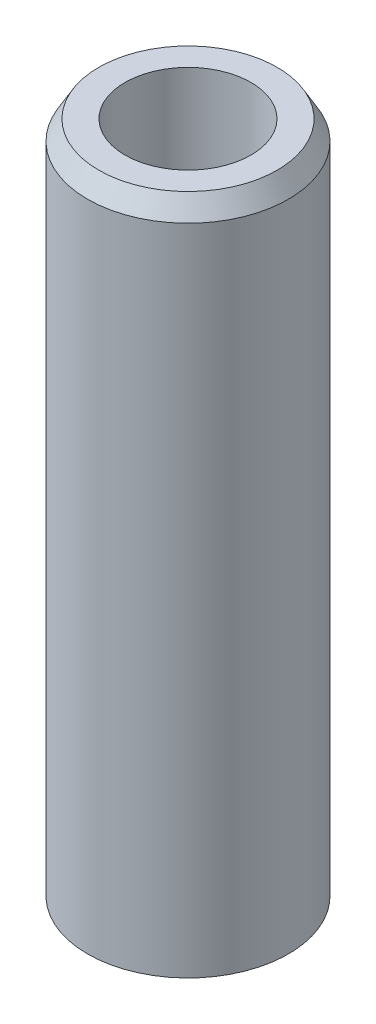
ISO-10303-21;
HEADER;
FILE_DESCRIPTION(('STEP AP214'),'2;1');
FILE_NAME('part.step','',(''),(''),'','','');
FILE_SCHEMA(('AUTOMOTIVE_DESIGN { 1 0 10303 214 1 1 1 1 }'));
ENDSEC;
DATA;
#1=APPLICATION_CONTEXT('core data for automotive mechanical design processes');
#2=APPLICATION_PROTOCOL_DEFINITION('international standard','automotive_design',2000,#1);
#3=PRODUCT_CONTEXT('',#1,'mechanical');
#4=PRODUCT('Part','Part','',(#3));
#5=PRODUCT_RELATED_PRODUCT_CATEGORY('part','',(#4));
#6=PRODUCT_DEFINITION_FORMATION('','',#4);
#7=PRODUCT_DEFINITION_CONTEXT('part definition',#1,'design');
#8=PRODUCT_DEFINITION('design','',#6,#7);
#9=PRODUCT_DEFINITION_SHAPE('','',#8);
#10=(LENGTH_UNIT() NAMED_UNIT(*) SI_UNIT(.MILLI.,.METRE.));
#11=(NAMED_UNIT(*) PLANE_ANGLE_UNIT() SI_UNIT($,.RADIAN.));
#12=(NAMED_UNIT(*) SI_UNIT($,.STERADIAN.) SOLID_ANGLE_UNIT());
#13=UNCERTAINTY_MEASURE_WITH_UNIT(LENGTH_MEASURE(1.E-05),#10,'distance_accuracy_value','');
#14=(GEOMETRIC_REPRESENTATION_CONTEXT(3) GLOBAL_UNCERTAINTY_ASSIGNED_CONTEXT((#13)) GLOBAL_UNIT_ASSIGNED_CONTEXT((#10,
#11,#12)) REPRESENTATION_CONTEXT('',''));
#15=CARTESIAN_POINT('',(0.,0.,0.));
#16=DIRECTION('',(0.,0.,1.));
#17=DIRECTION('',(1.,0.,0.));
#18=AXIS2_PLACEMENT_3D('',#15,#16,#17);
#19=CARTESIAN_POINT('',(0.,51.1065129858663,0.));
#20=DIRECTION('',(0.,-1.,0.));
#21=DIRECTION('',(0.,0.,-1.));
#22=AXIS2_PLACEMENT_3D('',#19,#20,#21);
#23=CYLINDRICAL_SURFACE('',#22,7.5);
#24=CARTESIAN_POINT('',(0.,49.6497257569355,0.));
#25=DIRECTION('',(0.,1.,0.));
#26=DIRECTION('',(0.,0.,1.));
#27=AXIS2_PLACEMENT_3D('',#24,#25,#26);
#28=CIRCLE('',#27,7.5);
#29=CARTESIAN_POINT('',(0.,49.6497257569355,7.5));
#30=VERTEX_POINT('',#29);
#31=EDGE_CURVE('E50',#30,#30,#28,.F.);
#32=ORIENTED_EDGE('',*,*,#31,.T.);
#33=EDGE_LOOP('',(#32));
#34=FACE_BOUND('',#33,.T.);
#35=CARTESIAN_POINT('',(0.,0.841076498775191,0.));
#36=DIRECTION('',(0.,1.,0.));
#37=DIRECTION('',(0.,0.,1.));
#38=AXIS2_PLACEMENT_3D('',#35,#36,#37);
#39=CIRCLE('',#38,7.5);
#40=CARTESIAN_POINT('',(0.,0.841076498775191,7.5));
#41=VERTEX_POINT('',#40);
#42=EDGE_CURVE('E51',#41,#41,#39,.T.);
#43=ORIENTED_EDGE('',*,*,#42,.T.);
#44=EDGE_LOOP('',(#43));
#45=FACE_BOUND('',#44,.T.);
#46=ADVANCED_FACE('F39',(#34,#45),#23,.T.);
#47=CARTESIAN_POINT('',(0.,51.1065129858663,0.));
#48=DIRECTION('',(0.,1.,0.));
#49=DIRECTION('',(0.,0.,1.));
#50=AXIS2_PLACEMENT_3D('',#47,#48,#49);
#51=PLANE('',#50);
#52=CARTESIAN_POINT('',(0.,51.1065129858663,0.));
#53=DIRECTION('',(0.,1.,0.));
#54=DIRECTION('',(0.,0.,1.));
#55=AXIS2_PLACEMENT_3D('',#52,#53,#54);
#56=CIRCLE('',#55,6.65892350122481);
#57=CARTESIAN_POINT('',(0.,51.1065129858663,6.65892350122481));
#58=VERTEX_POINT('',#57);
#59=EDGE_CURVE('E54',#58,#58,#56,.T.);
#60=ORIENTED_EDGE('',*,*,#59,.T.);
#61=EDGE_LOOP('',(#60));
#62=FACE_BOUND('',#61,.T.);
#63=CARTESIAN_POINT('',(0.,51.1065129858663,0.));
#64=DIRECTION('',(0.,1.,0.));
#65=DIRECTION('',(0.,0.,1.));
#66=AXIS2_PLACEMENT_3D('',#63,#64,#65);
#67=CIRCLE('',#66,4.70204244087108);
#68=CARTESIAN_POINT('',(0.,51.1065129858663,4.70204244087108));
#69=VERTEX_POINT('',#68);
#70=EDGE_CURVE('E58',#69,#69,#67,.T.);
#71=ORIENTED_EDGE('',*,*,#70,.F.);
#72=EDGE_LOOP('',(#71));
#73=FACE_BOUND('',#72,.T.);
#74=ADVANCED_FACE('F69',(#62,#73),#51,.T.);
#75=CARTESIAN_POINT('',(0.,0.,0.));
#76=DIRECTION('',(0.,1.,0.));
#77=DIRECTION('',(0.,0.,1.));
#78=AXIS2_PLACEMENT_3D('',#75,#76,#77);
#79=PLANE('',#78);
#80=CARTESIAN_POINT('',(0.,0.,0.));
#81=DIRECTION('',(0.,1.,0.));
#82=DIRECTION('',(0.,0.,1.));
#83=AXIS2_PLACEMENT_3D('',#80,#81,#82);
#84=CIRCLE('',#83,6.04321277106921);
#85=CARTESIAN_POINT('',(0.,0.,6.04321277106921));
#86=VERTEX_POINT('',#85);
#87=EDGE_CURVE('E10',#86,#86,#84,.F.);
#88=ORIENTED_EDGE('',*,*,#87,.T.);
#89=EDGE_LOOP('',(#88));
#90=FACE_BOUND('',#89,.T.);
#91=CARTESIAN_POINT('',(0.,0.,0.));
#92=DIRECTION('',(0.,1.,0.));
#93=DIRECTION('',(0.,0.,1.));
#94=AXIS2_PLACEMENT_3D('',#91,#92,#93);
#95=CIRCLE('',#94,4.70204244087108);
#96=CARTESIAN_POINT('',(0.,0.,4.70204244087108));
#97=VERTEX_POINT('',#96);
#98=EDGE_CURVE('E63',#97,#97,#95,.T.);
#99=ORIENTED_EDGE('',*,*,#98,.T.);
#100=EDGE_LOOP('',(#99));
#101=FACE_BOUND('',#100,.T.);
#102=ADVANCED_FACE('F75',(#90,#101),#79,.F.);
#103=CARTESIAN_POINT('',(0.,51.1065129858663,0.));
#104=DIRECTION('',(0.,-1.,0.));
#105=DIRECTION('',(0.,0.,-1.));
#106=AXIS2_PLACEMENT_3D('',#103,#104,#105);
#107=CYLINDRICAL_SURFACE('',#106,4.70204244087108);
#108=ORIENTED_EDGE('',*,*,#70,.T.);
#109=EDGE_LOOP('',(#108));
#110=FACE_BOUND('',#109,.T.);
#111=ORIENTED_EDGE('',*,*,#98,.F.);
#112=EDGE_LOOP('',(#111));
#113=FACE_BOUND('',#112,.T.);
#114=ADVANCED_FACE('F70',(#110,#113),#107,.F.);
#115=CARTESIAN_POINT('',(0.,51.1065129858663,0.));
#116=DIRECTION('',(0.,-1.,0.));
#117=DIRECTION('',(0.,0.,-1.));
#118=AXIS2_PLACEMENT_3D('',#115,#116,#117);
#119=CONICAL_SURFACE('',#118,6.65892350122481,0.523598775598296);
#120=ORIENTED_EDGE('',*,*,#31,.F.);
#121=EDGE_LOOP('',(#120));
#122=FACE_BOUND('',#121,.T.);
#123=ORIENTED_EDGE('',*,*,#59,.F.);
#124=EDGE_LOOP('',(#123));
#125=FACE_BOUND('',#124,.T.);
#126=ADVANCED_FACE('F81',(#122,#125),#119,.T.);
#127=CARTESIAN_POINT('',(0.,0.841076498775191,0.));
#128=DIRECTION('',(0.,1.,0.));
#129=DIRECTION('',(0.,0.,1.));
#130=AXIS2_PLACEMENT_3D('',#127,#128,#129);
#131=CONICAL_SURFACE('',#130,7.5,1.0471975511966);
#132=CARTESIAN_POINT('',(0.,0.,6.04321277106921));
#133=CARTESIAN_POINT('',(0.,0.00876121352890801,6.05838763803724));
#134=CARTESIAN_POINT('',(0.,0.0175224270578163,6.07356250500527));
#135=CARTESIAN_POINT('',(0.,0.0350448541156328,6.10391223894133));
#136=CARTESIAN_POINT('',(0.,0.0438060676445411,6.11908710590936));
#137=CARTESIAN_POINT('',(0.,0.0613284947023576,6.14943683984542));
#138=CARTESIAN_POINT('',(0.,0.0700897082312658,6.16461170681345));
#139=CARTESIAN_POINT('',(0.,0.0876121352890823,6.1949614407495));
#140=CARTESIAN_POINT('',(0.,0.0963733488179905,6.21013630771753));
#141=CARTESIAN_POINT('',(0.,0.113895775875807,6.24048604165359));
#142=CARTESIAN_POINT('',(0.,0.122656989404715,6.25566090862162));
#143=CARTESIAN_POINT('',(0.,0.140179416462532,6.28601064255768));
#144=CARTESIAN_POINT('',(0.,0.14894062999144,6.30118550952571));
#145=CARTESIAN_POINT('',(0.,0.166463057049256,6.33153524346177));
#146=CARTESIAN_POINT('',(0.,0.175224270578165,6.34671011042979));
#147=CARTESIAN_POINT('',(0.,0.192746697635981,6.37705984436585));
#148=CARTESIAN_POINT('',(0.,0.201507911164889,6.39223471133388));
#149=CARTESIAN_POINT('',(0.,0.219030338222706,6.42258444526994));
#150=CARTESIAN_POINT('',(0.,0.227791551751614,6.43775931223797));
#151=CARTESIAN_POINT('',(0.,0.245313978809431,6.46810904617403));
#152=CARTESIAN_POINT('',(0.,0.254075192338339,6.48328391314206));
#153=CARTESIAN_POINT('',(0.,0.271597619396155,6.51363364707811));
#154=CARTESIAN_POINT('',(0.,0.280358832925064,6.52880851404614));
#155=CARTESIAN_POINT('',(0.,0.29788125998288,6.5591582479822));
#156=CARTESIAN_POINT('',(0.,0.306642473511788,6.57433311495023));
#157=CARTESIAN_POINT('',(0.,0.324164900569605,6.60468284888629));
#158=CARTESIAN_POINT('',(0.,0.332926114098513,6.61985771585432));
#159=CARTESIAN_POINT('',(0.,0.35044854115633,6.65020744979037));
#160=CARTESIAN_POINT('',(0.,0.359209754685238,6.6653823167584));
#161=CARTESIAN_POINT('',(0.,0.376732181743054,6.69573205069446));
#162=CARTESIAN_POINT('',(0.,0.385493395271963,6.71090691766249));
#163=CARTESIAN_POINT('',(0.,0.403015822329779,6.74125665159855));
#164=CARTESIAN_POINT('',(0.,0.411777035858687,6.75643151856658));
#165=CARTESIAN_POINT('',(0.,0.429299462916504,6.78678125250264));
#166=CARTESIAN_POINT('',(0.,0.438060676445412,6.80195611947067));
#167=CARTESIAN_POINT('',(0.,0.455583103503228,6.83230585340672));
#168=CARTESIAN_POINT('',(0.,0.464344317032137,6.84748072037475));
#169=CARTESIAN_POINT('',(0.,0.481866744089953,6.87783045431081));
#170=CARTESIAN_POINT('',(0.,0.490627957618861,6.89300532127884));
#171=CARTESIAN_POINT('',(0.,0.508150384676678,6.9233550552149));
#172=CARTESIAN_POINT('',(0.,0.516911598205586,6.93852992218293));
#173=CARTESIAN_POINT('',(0.,0.534434025263402,6.96887965611898));
#174=CARTESIAN_POINT('',(0.,0.543195238792311,6.98405452308701));
#175=CARTESIAN_POINT('',(0.,0.560717665850127,7.01440425702307));
#176=CARTESIAN_POINT('',(0.,0.569478879379036,7.0295791239911));
#177=CARTESIAN_POINT('',(0.,0.587001306436852,7.05992885792716));
#178=CARTESIAN_POINT('',(0.,0.59576251996576,7.07510372489519));
#179=CARTESIAN_POINT('',(0.,0.613284947023577,7.10545345883124));
#180=CARTESIAN_POINT('',(0.,0.622046160552485,7.12062832579927));
#181=CARTESIAN_POINT('',(0.,0.639568587610301,7.15097805973533));
#182=CARTESIAN_POINT('',(0.,0.64832980113921,7.16615292670336));
#183=CARTESIAN_POINT('',(0.,0.665852228197026,7.19650266063942));
#184=CARTESIAN_POINT('',(0.,0.674613441725935,7.21167752760745));
#185=CARTESIAN_POINT('',(0.,0.692135868783751,7.24202726154351));
#186=CARTESIAN_POINT('',(0.,0.700897082312659,7.25720212851154));
#187=CARTESIAN_POINT('',(0.,0.718419509370475,7.28755186244759));
#188=CARTESIAN_POINT('',(0.,0.727180722899384,7.30272672941562));
#189=CARTESIAN_POINT('',(0.,0.7447031499572,7.33307646335168));
#190=CARTESIAN_POINT('',(0.,0.753464363486109,7.34825133031971));
#191=CARTESIAN_POINT('',(0.,0.770986790543925,7.37860106425577));
#192=CARTESIAN_POINT('',(0.,0.779748004072833,7.3937759312238));
#193=CARTESIAN_POINT('',(0.,0.79727043113065,7.42412566515985));
#194=CARTESIAN_POINT('',(0.,0.806031644659558,7.43930053212788));
#195=CARTESIAN_POINT('',(0.,0.823554071717374,7.46965026606394));
#196=CARTESIAN_POINT('',(0.,0.832315285246283,7.48482513303197));
#197=CARTESIAN_POINT('',(0.,0.841076498775191,7.5));
#198=B_SPLINE_CURVE_WITH_KNOTS('',3,(#132,#133,#134,#135,#136,#137,#138,#139,#140,#141,#142,
#143,#144,#145,#146,#147,#148,#149,#150,#151,#152,#153,#154,#155,#156,#157,#158,#159,#160,#161,
#162,#163,#164,#165,#166,#167,#168,#169,#170,#171,#172,#173,#174,#175,#176,#177,#178,#179,#180,
#181,#182,#183,#184,#185,#186,#187,#188,#189,#190,#191,#192,#193,#194,#195,#196,#197),
.UNSPECIFIED.,.F.,.F.,(4,2,2,2,2,2,2,2,2,2,2,2,2,2,2,2,2,2,2,2,2,2,2,2,2,2,2,2,2,2,2,2,4),(0.,
0.0525672811734503,0.1051345623469,0.157701843520349,0.210269124693799,0.262836405867249,
0.315403687040699,0.367970968214148,0.420538249387599,0.473105530561048,0.525672811734498,
0.578240092907947,0.630807374081398,0.683374655254847,0.735941936428297,0.788509217601746,
0.841076498775197,0.893643779948646,0.946211061122096,0.998778342295545,1.051345623469,
1.10391290464245,1.15648018581589,1.20904746698934,1.26161474816279,1.31418202933624,
1.36674931050969,1.41931659168314,1.47188387285659,1.52445115403004,1.57701843520349,
1.62958571637694,1.68215299755039),.UNSPECIFIED.);
#199=EDGE_CURVE('BSEAM45',#86,#41,#198,.T.);
#200=ORIENTED_EDGE('',*,*,#87,.F.);
#201=ORIENTED_EDGE('',*,*,#42,.F.);
#202=ORIENTED_EDGE('',*,*,#199,.T.);
#203=ORIENTED_EDGE('',*,*,#199,.F.);
#204=EDGE_LOOP('',(#200,#202,#201,#203));
#205=FACE_BOUND('',#204,.T.);
#206=ADVANCED_FACE('F45',(#205),#131,.T.);
#207=CLOSED_SHELL('',(#46,#74,#102,#114,#126,#206));
#208=MANIFOLD_SOLID_BREP('B2',#207);
#209=ADVANCED_BREP_SHAPE_REPRESENTATION('',(#18,#208),#14);
#210=SHAPE_DEFINITION_REPRESENTATION(#9,#209);
ENDSEC;
END-ISO-10303-21;
